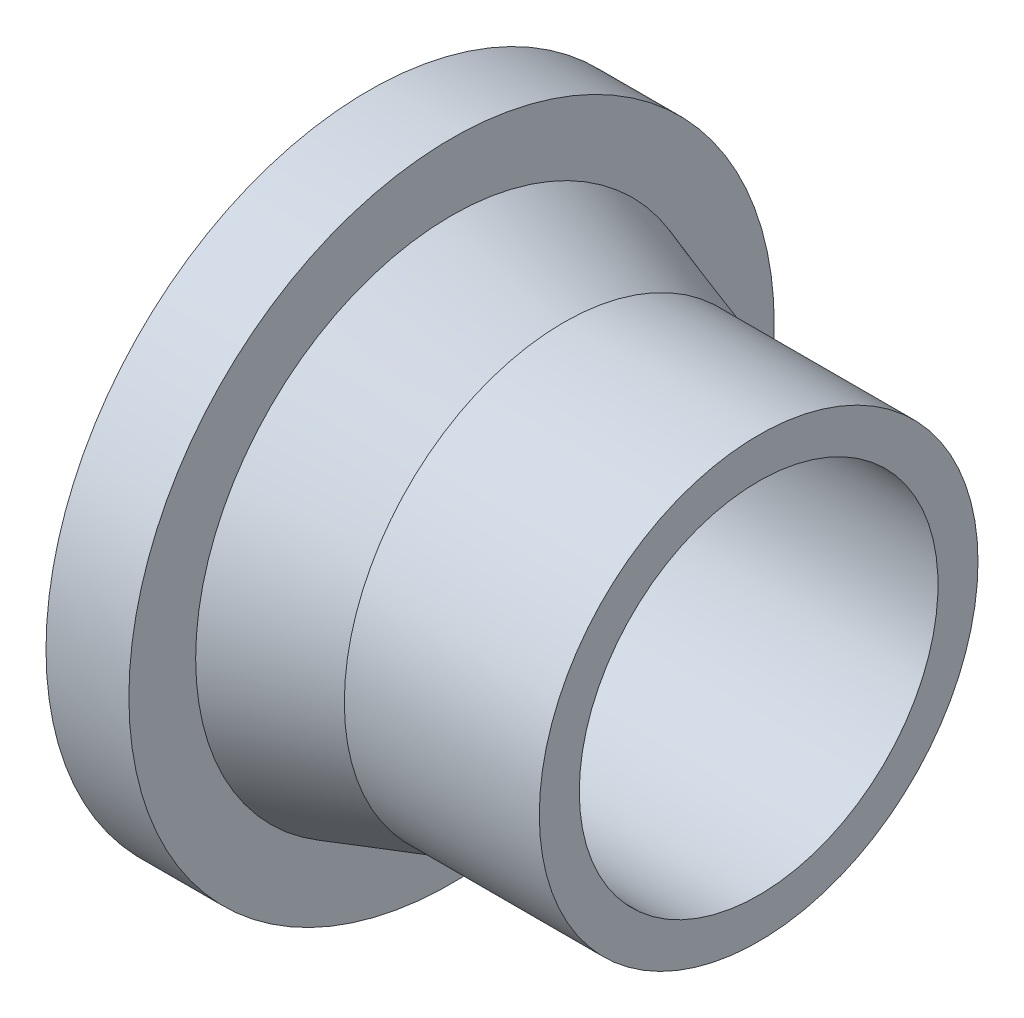
ISO-10303-21;
HEADER;
FILE_DESCRIPTION(('STEP AP214'),'2;1');
FILE_NAME('part.step','',(''),(''),'','','');
FILE_SCHEMA(('AUTOMOTIVE_DESIGN { 1 0 10303 214 1 1 1 1 }'));
ENDSEC;
DATA;
#1=APPLICATION_CONTEXT('core data for automotive mechanical design processes');
#2=APPLICATION_PROTOCOL_DEFINITION('international standard','automotive_design',2000,#1);
#3=PRODUCT_CONTEXT('',#1,'mechanical');
#4=PRODUCT('Part','Part','',(#3));
#5=PRODUCT_RELATED_PRODUCT_CATEGORY('part','',(#4));
#6=PRODUCT_DEFINITION_FORMATION('','',#4);
#7=PRODUCT_DEFINITION_CONTEXT('part definition',#1,'design');
#8=PRODUCT_DEFINITION('design','',#6,#7);
#9=PRODUCT_DEFINITION_SHAPE('','',#8);
#10=(LENGTH_UNIT() NAMED_UNIT(*) SI_UNIT(.MILLI.,.METRE.));
#11=(NAMED_UNIT(*) PLANE_ANGLE_UNIT() SI_UNIT($,.RADIAN.));
#12=(NAMED_UNIT(*) SI_UNIT($,.STERADIAN.) SOLID_ANGLE_UNIT());
#13=UNCERTAINTY_MEASURE_WITH_UNIT(LENGTH_MEASURE(1.E-05),#10,'distance_accuracy_value','');
#14=(GEOMETRIC_REPRESENTATION_CONTEXT(3) GLOBAL_UNCERTAINTY_ASSIGNED_CONTEXT((#13)) GLOBAL_UNIT_ASSIGNED_CONTEXT((#10,
#11,#12)) REPRESENTATION_CONTEXT('',''));
#15=CARTESIAN_POINT('',(0.,0.,0.));
#16=DIRECTION('',(0.,0.,1.));
#17=DIRECTION('',(1.,0.,0.));
#18=AXIS2_PLACEMENT_3D('',#15,#16,#17);
#19=CARTESIAN_POINT('',(-40.,0.,0.));
#20=DIRECTION('',(-1.,0.,0.));
#21=DIRECTION('',(0.,0.,1.));
#22=AXIS2_PLACEMENT_3D('',#19,#20,#21);
#23=CONICAL_SURFACE('',#22,45.,0.315214699750711);
#24=CARTESIAN_POINT('',(-63.,0.,0.));
#25=DIRECTION('',(-1.,0.,0.));
#26=DIRECTION('',(0.,0.,1.));
#27=AXIS2_PLACEMENT_3D('',#24,#25,#26);
#28=CIRCLE('',#27,52.5);
#29=CARTESIAN_POINT('',(-63.,0.,52.5));
#30=VERTEX_POINT('',#29);
#31=EDGE_CURVE('E16',#30,#30,#28,.T.);
#32=ORIENTED_EDGE('',*,*,#31,.F.);
#33=EDGE_LOOP('',(#32));
#34=FACE_BOUND('',#33,.T.);
#35=CARTESIAN_POINT('',(-40.,0.,0.));
#36=DIRECTION('',(-1.,0.,0.));
#37=DIRECTION('',(0.,1.,0.));
#38=AXIS2_PLACEMENT_3D('',#35,#36,#37);
#39=CIRCLE('',#38,45.);
#40=CARTESIAN_POINT('',(-40.,45.,0.));
#41=VERTEX_POINT('',#40);
#42=EDGE_CURVE('E28',#41,#41,#39,.F.);
#43=ORIENTED_EDGE('',*,*,#42,.F.);
#44=EDGE_LOOP('',(#43));
#45=FACE_BOUND('',#44,.T.);
#46=ADVANCED_FACE('F13',(#34,#45),#23,.T.);
#47=CARTESIAN_POINT('',(-63.,66.2,66.9944021084201));
#48=DIRECTION('',(1.,0.,0.));
#49=DIRECTION('',(0.,-1.,0.));
#50=AXIS2_PLACEMENT_3D('',#47,#48,#49);
#51=PLANE('',#50);
#52=ORIENTED_EDGE('',*,*,#31,.T.);
#53=EDGE_LOOP('',(#52));
#54=FACE_BOUND('',#53,.T.);
#55=CARTESIAN_POINT('',(-63.,0.,0.));
#56=DIRECTION('',(-1.,0.,0.));
#57=DIRECTION('',(0.,0.,1.));
#58=AXIS2_PLACEMENT_3D('',#55,#56,#57);
#59=CIRCLE('',#58,66.2);
#60=CARTESIAN_POINT('',(-63.,0.,66.2));
#61=VERTEX_POINT('',#60);
#62=EDGE_CURVE('E34',#61,#61,#59,.T.);
#63=ORIENTED_EDGE('',*,*,#62,.F.);
#64=EDGE_LOOP('',(#63));
#65=FACE_BOUND('',#64,.T.);
#66=ADVANCED_FACE('F44',(#54,#65),#51,.T.);
#67=CARTESIAN_POINT('',(-40.,0.,0.));
#68=DIRECTION('',(-1.,0.,0.));
#69=DIRECTION('',(0.,0.,1.));
#70=AXIS2_PLACEMENT_3D('',#67,#68,#69);
#71=CYLINDRICAL_SURFACE('',#70,45.);
#72=ORIENTED_EDGE('',*,*,#42,.T.);
#73=EDGE_LOOP('',(#72));
#74=FACE_BOUND('',#73,.T.);
#75=CARTESIAN_POINT('',(0.,0.,0.));
#76=DIRECTION('',(-1.,0.,0.));
#77=DIRECTION('',(0.,0.,1.));
#78=AXIS2_PLACEMENT_3D('',#75,#76,#77);
#79=CIRCLE('',#78,45.);
#80=CARTESIAN_POINT('',(0.,0.,45.));
#81=VERTEX_POINT('',#80);
#82=EDGE_CURVE('E32',#81,#81,#79,.F.);
#83=ORIENTED_EDGE('',*,*,#82,.F.);
#84=EDGE_LOOP('',(#83));
#85=FACE_BOUND('',#84,.T.);
#86=ADVANCED_FACE('F53',(#74,#85),#71,.T.);
#87=CARTESIAN_POINT('',(-80.,0.,0.));
#88=DIRECTION('',(-1.,0.,0.));
#89=DIRECTION('',(0.,0.,1.));
#90=AXIS2_PLACEMENT_3D('',#87,#88,#89);
#91=CYLINDRICAL_SURFACE('',#90,66.2);
#92=CARTESIAN_POINT('',(-80.,0.,0.));
#93=DIRECTION('',(-1.,0.,0.));
#94=DIRECTION('',(0.,0.,1.));
#95=AXIS2_PLACEMENT_3D('',#92,#93,#94);
#96=CIRCLE('',#95,66.2);
#97=CARTESIAN_POINT('',(-80.,0.,66.2));
#98=VERTEX_POINT('',#97);
#99=EDGE_CURVE('E25',#98,#98,#96,.T.);
#100=ORIENTED_EDGE('',*,*,#99,.F.);
#101=EDGE_LOOP('',(#100));
#102=FACE_BOUND('',#101,.T.);
#103=ORIENTED_EDGE('',*,*,#62,.T.);
#104=EDGE_LOOP('',(#103));
#105=FACE_BOUND('',#104,.T.);
#106=ADVANCED_FACE('F68',(#102,#105),#91,.T.);
#107=CARTESIAN_POINT('',(0.,45.,45.5400021084165));
#108=DIRECTION('',(1.,0.,0.));
#109=DIRECTION('',(0.,-1.,0.));
#110=AXIS2_PLACEMENT_3D('',#107,#108,#109);
#111=PLANE('',#110);
#112=CARTESIAN_POINT('',(0.,0.,0.));
#113=DIRECTION('',(-1.,0.,0.));
#114=DIRECTION('',(0.,0.,1.));
#115=AXIS2_PLACEMENT_3D('',#112,#113,#114);
#116=CIRCLE('',#115,36.8);
#117=CARTESIAN_POINT('',(0.,0.,36.8));
#118=VERTEX_POINT('',#117);
#119=EDGE_CURVE('E20',#118,#118,#116,.F.);
#120=ORIENTED_EDGE('',*,*,#119,.F.);
#121=EDGE_LOOP('',(#120));
#122=FACE_BOUND('',#121,.T.);
#123=ORIENTED_EDGE('',*,*,#82,.T.);
#124=EDGE_LOOP('',(#123));
#125=FACE_BOUND('',#124,.T.);
#126=ADVANCED_FACE('F62',(#122,#125),#111,.T.);
#127=CARTESIAN_POINT('',(-80.,-66.2,66.9944021086368));
#128=DIRECTION('',(-1.,0.,0.));
#129=DIRECTION('',(0.,1.,0.));
#130=AXIS2_PLACEMENT_3D('',#127,#128,#129);
#131=PLANE('',#130);
#132=CARTESIAN_POINT('',(-80.,0.,0.));
#133=DIRECTION('',(-1.,0.,0.));
#134=DIRECTION('',(0.,0.,1.));
#135=AXIS2_PLACEMENT_3D('',#132,#133,#134);
#136=CIRCLE('',#135,36.8);
#137=CARTESIAN_POINT('',(-80.,0.,36.8));
#138=VERTEX_POINT('',#137);
#139=EDGE_CURVE('E8',#138,#138,#136,.T.);
#140=ORIENTED_EDGE('',*,*,#139,.F.);
#141=EDGE_LOOP('',(#140));
#142=FACE_BOUND('',#141,.T.);
#143=ORIENTED_EDGE('',*,*,#99,.T.);
#144=EDGE_LOOP('',(#143));
#145=FACE_BOUND('',#144,.T.);
#146=ADVANCED_FACE('F56',(#142,#145),#131,.T.);
#147=CARTESIAN_POINT('',(0.,0.,0.));
#148=DIRECTION('',(-1.,0.,0.));
#149=DIRECTION('',(0.,0.,1.));
#150=AXIS2_PLACEMENT_3D('',#147,#148,#149);
#151=CYLINDRICAL_SURFACE('',#150,36.8);
#152=ORIENTED_EDGE('',*,*,#119,.T.);
#153=EDGE_LOOP('',(#152));
#154=FACE_BOUND('',#153,.T.);
#155=ORIENTED_EDGE('',*,*,#139,.T.);
#156=EDGE_LOOP('',(#155));
#157=FACE_BOUND('',#156,.T.);
#158=ADVANCED_FACE('F54',(#154,#157),#151,.F.);
#159=CLOSED_SHELL('',(#46,#66,#86,#106,#126,#146,#158));
#160=MANIFOLD_SOLID_BREP('B1',#159);
#161=ADVANCED_BREP_SHAPE_REPRESENTATION('',(#18,#160),#14);
#162=SHAPE_DEFINITION_REPRESENTATION(#9,#161);
ENDSEC;
END-ISO-10303-21;
